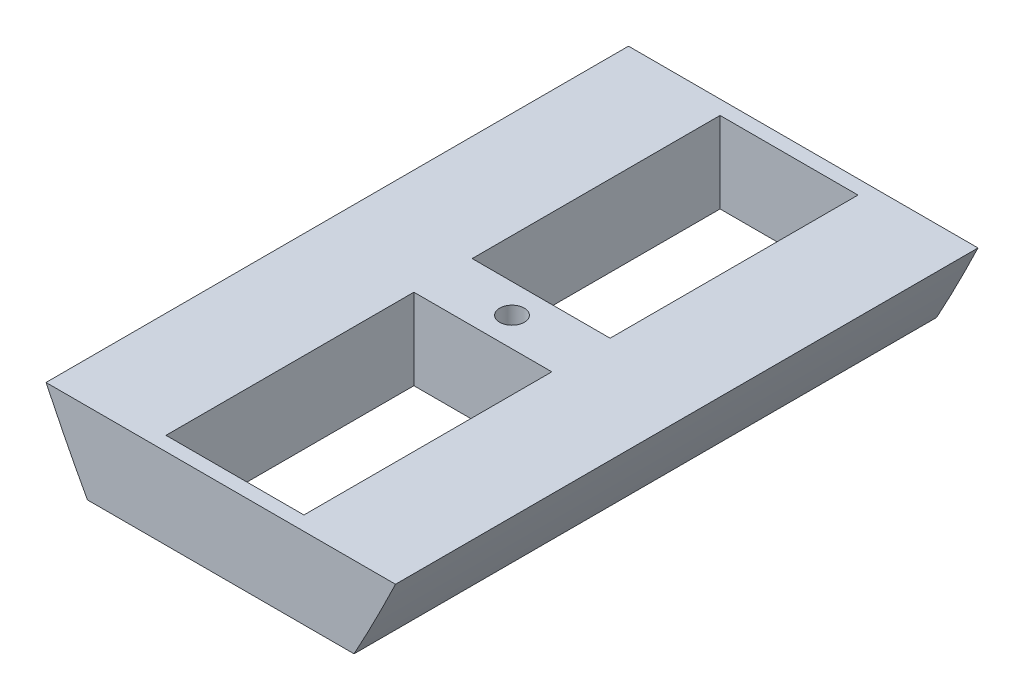
ISO-10303-21;
HEADER;
FILE_DESCRIPTION(('STEP AP214'),'2;1');
FILE_NAME('part.step','',(''),(''),'','','');
FILE_SCHEMA(('AUTOMOTIVE_DESIGN { 1 0 10303 214 1 1 1 1 }'));
ENDSEC;
DATA;
#1=APPLICATION_CONTEXT('core data for automotive mechanical design processes');
#2=APPLICATION_PROTOCOL_DEFINITION('international standard','automotive_design',2000,#1);
#3=PRODUCT_CONTEXT('',#1,'mechanical');
#4=PRODUCT('Part','Part','',(#3));
#5=PRODUCT_RELATED_PRODUCT_CATEGORY('part','',(#4));
#6=PRODUCT_DEFINITION_FORMATION('','',#4);
#7=PRODUCT_DEFINITION_CONTEXT('part definition',#1,'design');
#8=PRODUCT_DEFINITION('design','',#6,#7);
#9=PRODUCT_DEFINITION_SHAPE('','',#8);
#10=(LENGTH_UNIT() NAMED_UNIT(*) SI_UNIT(.MILLI.,.METRE.));
#11=(NAMED_UNIT(*) PLANE_ANGLE_UNIT() SI_UNIT($,.RADIAN.));
#12=(NAMED_UNIT(*) SI_UNIT($,.STERADIAN.) SOLID_ANGLE_UNIT());
#13=UNCERTAINTY_MEASURE_WITH_UNIT(LENGTH_MEASURE(1.E-05),#10,'distance_accuracy_value','');
#14=(GEOMETRIC_REPRESENTATION_CONTEXT(3) GLOBAL_UNCERTAINTY_ASSIGNED_CONTEXT((#13)) GLOBAL_UNIT_ASSIGNED_CONTEXT((#10,
#11,#12)) REPRESENTATION_CONTEXT('',''));
#15=CARTESIAN_POINT('',(0.,0.,0.));
#16=DIRECTION('',(0.,0.,1.));
#17=DIRECTION('',(1.,0.,0.));
#18=AXIS2_PLACEMENT_3D('',#15,#16,#17);
#19=CARTESIAN_POINT('',(0.,-41.72,0.));
#20=DIRECTION('',(0.,1.,0.));
#21=DIRECTION('',(0.,0.,1.));
#22=AXIS2_PLACEMENT_3D('',#19,#20,#21);
#23=PLANE('',#22);
#24=DIRECTION('',(1.,0.,0.));
#25=VECTOR('',#24,1.);
#26=CARTESIAN_POINT('',(-52.7426338619544,-41.72,-150.));
#27=LINE('',#26,#25);
#28=CARTESIAN_POINT('',(-68.6535478647462,-41.7200000000003,-150.));
#29=VERTEX_POINT('',#28);
#30=CARTESIAN_POINT('',(68.6535448442305,-41.7199999999999,-150.));
#31=VERTEX_POINT('',#30);
#32=EDGE_CURVE('E131',#29,#31,#27,.T.);
#33=ORIENTED_EDGE('',*,*,#32,.T.);
#34=DIRECTION('',(0.,0.,1.));
#35=VECTOR('',#34,1.);
#36=CARTESIAN_POINT('',(68.6535448442304,-41.72,-150.));
#37=LINE('',#36,#35);
#38=CARTESIAN_POINT('',(68.6535448442305,-41.7199999999999,150.));
#39=VERTEX_POINT('',#38);
#40=EDGE_CURVE('E138',#31,#39,#37,.T.);
#41=ORIENTED_EDGE('',*,*,#40,.T.);
#42=DIRECTION('',(1.,0.,0.));
#43=VECTOR('',#42,1.);
#44=CARTESIAN_POINT('',(-52.7426338619544,-41.72,150.));
#45=LINE('',#44,#43);
#46=CARTESIAN_POINT('',(-68.6535478647462,-41.7200000000003,150.));
#47=VERTEX_POINT('',#46);
#48=EDGE_CURVE('E133',#47,#39,#45,.T.);
#49=ORIENTED_EDGE('',*,*,#48,.F.);
#50=DIRECTION('',(0.,0.,1.));
#51=VECTOR('',#50,1.);
#52=CARTESIAN_POINT('',(-68.6535478647463,-41.72,-150.));
#53=LINE('',#52,#51);
#54=EDGE_CURVE('E127',#47,#29,#53,.F.);
#55=ORIENTED_EDGE('',*,*,#54,.T.);
#56=EDGE_LOOP('',(#33,#41,#49,#55));
#57=FACE_BOUND('',#56,.T.);
#58=CARTESIAN_POINT('',(0.,-41.72,0.));
#59=DIRECTION('',(0.,1.,0.));
#60=DIRECTION('',(0.,0.,1.));
#61=AXIS2_PLACEMENT_3D('',#58,#59,#60);
#62=CIRCLE('',#61,6.35);
#63=CARTESIAN_POINT('',(0.,-41.72,6.35));
#64=VERTEX_POINT('',#63);
#65=EDGE_CURVE('E160',#64,#64,#62,.F.);
#66=ORIENTED_EDGE('',*,*,#65,.F.);
#67=EDGE_LOOP('',(#66));
#68=FACE_BOUND('',#67,.T.);
#69=DIRECTION('',(1.,0.,0.));
#70=VECTOR('',#69,1.);
#71=CARTESIAN_POINT('',(35.5199999999569,-41.72,15.));
#72=LINE('',#71,#70);
#73=CARTESIAN_POINT('',(-35.5200000000194,-41.72,15.));
#74=VERTEX_POINT('',#73);
#75=CARTESIAN_POINT('',(35.5199999999806,-41.72,15.));
#76=VERTEX_POINT('',#75);
#77=EDGE_CURVE('E222',#74,#76,#72,.T.);
#78=ORIENTED_EDGE('',*,*,#77,.F.);
#79=DIRECTION('',(0.,0.,-1.));
#80=VECTOR('',#79,1.);
#81=CARTESIAN_POINT('',(-35.5200000000195,-41.72,142.682));
#82=LINE('',#81,#80);
#83=CARTESIAN_POINT('',(-35.5200000000195,-41.72,142.682));
#84=VERTEX_POINT('',#83);
#85=EDGE_CURVE('E221',#84,#74,#82,.T.);
#86=ORIENTED_EDGE('',*,*,#85,.F.);
#87=DIRECTION('',(-1.,0.,0.));
#88=VECTOR('',#87,1.);
#89=CARTESIAN_POINT('',(35.5199999999569,-41.72,142.682));
#90=LINE('',#89,#88);
#91=CARTESIAN_POINT('',(35.5199999999805,-41.72,142.682));
#92=VERTEX_POINT('',#91);
#93=EDGE_CURVE('E219',#92,#84,#90,.T.);
#94=ORIENTED_EDGE('',*,*,#93,.F.);
#95=DIRECTION('',(0.,0.,1.));
#96=VECTOR('',#95,1.);
#97=CARTESIAN_POINT('',(35.5199999999805,-41.72,142.682));
#98=LINE('',#97,#96);
#99=EDGE_CURVE('E217',#76,#92,#98,.T.);
#100=ORIENTED_EDGE('',*,*,#99,.F.);
#101=EDGE_LOOP('',(#78,#86,#94,#100));
#102=FACE_BOUND('',#101,.T.);
#103=DIRECTION('',(-1.,0.,0.));
#104=VECTOR('',#103,1.);
#105=CARTESIAN_POINT('',(35.5199999999569,-41.72,-15.));
#106=LINE('',#105,#104);
#107=CARTESIAN_POINT('',(35.5199999999806,-41.72,-15.));
#108=VERTEX_POINT('',#107);
#109=CARTESIAN_POINT('',(-35.5200000000194,-41.72,-15.));
#110=VERTEX_POINT('',#109);
#111=EDGE_CURVE('E214',#108,#110,#106,.T.);
#112=ORIENTED_EDGE('',*,*,#111,.F.);
#113=DIRECTION('',(0.,0.,1.));
#114=VECTOR('',#113,1.);
#115=CARTESIAN_POINT('',(35.5199999999805,-41.72,-142.682));
#116=LINE('',#115,#114);
#117=CARTESIAN_POINT('',(35.5199999999805,-41.72,-142.682));
#118=VERTEX_POINT('',#117);
#119=EDGE_CURVE('E212',#118,#108,#116,.T.);
#120=ORIENTED_EDGE('',*,*,#119,.F.);
#121=DIRECTION('',(1.,0.,0.));
#122=VECTOR('',#121,1.);
#123=CARTESIAN_POINT('',(35.5199999999569,-41.72,-142.682));
#124=LINE('',#123,#122);
#125=CARTESIAN_POINT('',(-35.5200000000195,-41.72,-142.682));
#126=VERTEX_POINT('',#125);
#127=EDGE_CURVE('E210',#126,#118,#124,.T.);
#128=ORIENTED_EDGE('',*,*,#127,.F.);
#129=DIRECTION('',(0.,0.,-1.));
#130=VECTOR('',#129,1.);
#131=CARTESIAN_POINT('',(-35.5200000000195,-41.72,-142.682));
#132=LINE('',#131,#130);
#133=EDGE_CURVE('E208',#110,#126,#132,.T.);
#134=ORIENTED_EDGE('',*,*,#133,.F.);
#135=EDGE_LOOP('',(#112,#120,#128,#134));
#136=FACE_BOUND('',#135,.T.);
#137=ADVANCED_FACE('F33',(#57,#68,#102,#136),#23,.F.);
#138=CARTESIAN_POINT('',(35.5199999999569,-92.5200000000166,-142.682));
#139=DIRECTION('',(0.,0.,-1.));
#140=DIRECTION('',(-1.,0.,0.));
#141=AXIS2_PLACEMENT_3D('',#138,#139,#140);
#142=PLANE('',#141);
#143=DIRECTION('',(4.6610767750375E-13,1.,0.));
#144=VECTOR('',#143,1.);
#145=CARTESIAN_POINT('',(-35.5200000000431,-92.5199999999835,-142.682));
#146=LINE('',#145,#144);
#147=CARTESIAN_POINT('',(-35.52,1.65561447049332E-11,-142.682));
#148=VERTEX_POINT('',#147);
#149=EDGE_CURVE('E197',#126,#148,#146,.T.);
#150=ORIENTED_EDGE('',*,*,#149,.F.);
#151=ORIENTED_EDGE('',*,*,#127,.T.);
#152=DIRECTION('',(4.6610767750375E-13,1.,0.));
#153=VECTOR('',#152,1.);
#154=CARTESIAN_POINT('',(35.5199999999569,-92.5200000000166,-142.682));
#155=LINE('',#154,#153);
#156=CARTESIAN_POINT('',(35.52,-1.65561447049332E-11,-142.682));
#157=VERTEX_POINT('',#156);
#158=EDGE_CURVE('E195',#118,#157,#155,.T.);
#159=ORIENTED_EDGE('',*,*,#158,.T.);
#160=DIRECTION('',(-1.,4.6610767750375E-13,0.));
#161=VECTOR('',#160,1.);
#162=CARTESIAN_POINT('',(35.52,-1.65561447049332E-11,-142.682));
#163=LINE('',#162,#161);
#164=EDGE_CURVE('E192',#157,#148,#163,.T.);
#165=ORIENTED_EDGE('',*,*,#164,.T.);
#166=EDGE_LOOP('',(#150,#151,#159,#165));
#167=FACE_BOUND('',#166,.T.);
#168=ADVANCED_FACE('F170',(#167),#142,.F.);
#169=CARTESIAN_POINT('',(35.5199999999569,-92.5200000000166,142.682));
#170=DIRECTION('',(0.,0.,1.));
#171=DIRECTION('',(1.,0.,0.));
#172=AXIS2_PLACEMENT_3D('',#169,#170,#171);
#173=PLANE('',#172);
#174=DIRECTION('',(4.6610767750375E-13,1.,0.));
#175=VECTOR('',#174,1.);
#176=CARTESIAN_POINT('',(35.5199999999569,-92.5200000000166,142.682));
#177=LINE('',#176,#175);
#178=CARTESIAN_POINT('',(35.52,-1.65561447049332E-11,142.682));
#179=VERTEX_POINT('',#178);
#180=EDGE_CURVE('E187',#92,#179,#177,.T.);
#181=ORIENTED_EDGE('',*,*,#180,.F.);
#182=ORIENTED_EDGE('',*,*,#93,.T.);
#183=DIRECTION('',(4.6610767750375E-13,1.,0.));
#184=VECTOR('',#183,1.);
#185=CARTESIAN_POINT('',(-35.5200000000431,-92.5199999999835,142.682));
#186=LINE('',#185,#184);
#187=CARTESIAN_POINT('',(-35.52,1.65561447049332E-11,142.682));
#188=VERTEX_POINT('',#187);
#189=EDGE_CURVE('E60',#84,#188,#186,.T.);
#190=ORIENTED_EDGE('',*,*,#189,.T.);
#191=DIRECTION('',(1.,-4.6610767750375E-13,0.));
#192=VECTOR('',#191,1.);
#193=CARTESIAN_POINT('',(35.52,-1.65561447049332E-11,142.682));
#194=LINE('',#193,#192);
#195=EDGE_CURVE('E184',#188,#179,#194,.T.);
#196=ORIENTED_EDGE('',*,*,#195,.T.);
#197=EDGE_LOOP('',(#181,#182,#190,#196));
#198=FACE_BOUND('',#197,.T.);
#199=ADVANCED_FACE('F281',(#198),#173,.F.);
#200=CARTESIAN_POINT('',(-90.,0.,-150.));
#201=DIRECTION('',(0.,1.,0.));
#202=DIRECTION('',(0.,0.,1.));
#203=AXIS2_PLACEMENT_3D('',#200,#201,#202);
#204=PLANE('',#203);
#205=CARTESIAN_POINT('',(0.,0.,0.));
#206=DIRECTION('',(0.,1.,0.));
#207=DIRECTION('',(0.,0.,1.));
#208=AXIS2_PLACEMENT_3D('',#205,#206,#207);
#209=CIRCLE('',#208,6.35);
#210=CARTESIAN_POINT('',(0.,0.,6.35));
#211=VERTEX_POINT('',#210);
#212=EDGE_CURVE('E11',#211,#211,#209,.T.);
#213=ORIENTED_EDGE('',*,*,#212,.F.);
#214=EDGE_LOOP('',(#213));
#215=FACE_BOUND('',#214,.T.);
#216=DIRECTION('',(0.,0.,-1.));
#217=VECTOR('',#216,1.);
#218=CARTESIAN_POINT('',(35.52,-1.65561447049332E-11,142.682));
#219=LINE('',#218,#217);
#220=CARTESIAN_POINT('',(35.52,0.,15.));
#221=VERTEX_POINT('',#220);
#222=EDGE_CURVE('E44',#179,#221,#219,.T.);
#223=ORIENTED_EDGE('',*,*,#222,.F.);
#224=ORIENTED_EDGE('',*,*,#195,.F.);
#225=DIRECTION('',(0.,0.,1.));
#226=VECTOR('',#225,1.);
#227=CARTESIAN_POINT('',(-35.52,1.65561447049332E-11,142.682));
#228=LINE('',#227,#226);
#229=CARTESIAN_POINT('',(-35.52,1.65561447049332E-11,15.));
#230=VERTEX_POINT('',#229);
#231=EDGE_CURVE('E249',#230,#188,#228,.T.);
#232=ORIENTED_EDGE('',*,*,#231,.F.);
#233=DIRECTION('',(-1.,4.6610767750375E-13,0.));
#234=VECTOR('',#233,1.);
#235=CARTESIAN_POINT('',(35.52,-1.65561447049332E-11,15.));
#236=LINE('',#235,#234);
#237=EDGE_CURVE('E251',#221,#230,#236,.T.);
#238=ORIENTED_EDGE('',*,*,#237,.F.);
#239=EDGE_LOOP('',(#223,#224,#232,#238));
#240=FACE_BOUND('',#239,.T.);
#241=DIRECTION('',(0.,0.,1.));
#242=VECTOR('',#241,1.);
#243=CARTESIAN_POINT('',(-35.52,1.65561447049332E-11,-142.682));
#244=LINE('',#243,#242);
#245=CARTESIAN_POINT('',(-35.5200000000431,0.,-15.));
#246=VERTEX_POINT('',#245);
#247=EDGE_CURVE('E189',#148,#246,#244,.T.);
#248=ORIENTED_EDGE('',*,*,#247,.F.);
#249=ORIENTED_EDGE('',*,*,#164,.F.);
#250=DIRECTION('',(0.,0.,-1.));
#251=VECTOR('',#250,1.);
#252=CARTESIAN_POINT('',(35.52,-1.65561447049332E-11,-142.682));
#253=LINE('',#252,#251);
#254=CARTESIAN_POINT('',(35.52,-1.65561447049332E-11,-15.));
#255=VERTEX_POINT('',#254);
#256=EDGE_CURVE('E240',#255,#157,#253,.T.);
#257=ORIENTED_EDGE('',*,*,#256,.F.);
#258=DIRECTION('',(1.,-4.6610767750375E-13,0.));
#259=VECTOR('',#258,1.);
#260=CARTESIAN_POINT('',(35.52,-1.65561447049332E-11,-15.));
#261=LINE('',#260,#259);
#262=EDGE_CURVE('E243',#246,#255,#261,.T.);
#263=ORIENTED_EDGE('',*,*,#262,.F.);
#264=EDGE_LOOP('',(#248,#249,#257,#263));
#265=FACE_BOUND('',#264,.T.);
#266=DIRECTION('',(-1.,0.,0.));
#267=VECTOR('',#266,1.);
#268=CARTESIAN_POINT('',(-90.,0.,150.));
#269=LINE('',#268,#267);
#270=CARTESIAN_POINT('',(89.9999999999832,-1.11765701056352E-11,150.));
#271=VERTEX_POINT('',#270);
#272=CARTESIAN_POINT('',(-90.,0.,150.));
#273=VERTEX_POINT('',#272);
#274=EDGE_CURVE('E150',#271,#273,#269,.T.);
#275=ORIENTED_EDGE('',*,*,#274,.F.);
#276=DIRECTION('',(0.,0.,1.));
#277=VECTOR('',#276,1.);
#278=CARTESIAN_POINT('',(89.9999999999832,-1.11765701056352E-11,-150.));
#279=LINE('',#278,#277);
#280=CARTESIAN_POINT('',(89.9999999999832,-1.11765701056352E-11,-150.));
#281=VERTEX_POINT('',#280);
#282=EDGE_CURVE('E230',#281,#271,#279,.T.);
#283=ORIENTED_EDGE('',*,*,#282,.F.);
#284=DIRECTION('',(-1.,0.,0.));
#285=VECTOR('',#284,1.);
#286=CARTESIAN_POINT('',(-90.,0.,-150.));
#287=LINE('',#286,#285);
#288=CARTESIAN_POINT('',(-90.,0.,-150.));
#289=VERTEX_POINT('',#288);
#290=EDGE_CURVE('E154',#281,#289,#287,.T.);
#291=ORIENTED_EDGE('',*,*,#290,.T.);
#292=DIRECTION('',(0.,0.,1.));
#293=VECTOR('',#292,1.);
#294=CARTESIAN_POINT('',(-90.,0.,-150.));
#295=LINE('',#294,#293);
#296=EDGE_CURVE('E149',#289,#273,#295,.T.);
#297=ORIENTED_EDGE('',*,*,#296,.T.);
#298=EDGE_LOOP('',(#275,#283,#291,#297));
#299=FACE_BOUND('',#298,.T.);
#300=ADVANCED_FACE('F261',(#215,#240,#265,#299),#204,.T.);
#301=CARTESIAN_POINT('',(0.,-124.999999999991,0.));
#302=DIRECTION('',(0.,1.,0.));
#303=DIRECTION('',(0.,0.,1.));
#304=AXIS2_PLACEMENT_3D('',#301,#302,#303);
#305=CYLINDRICAL_SURFACE('',#304,6.35);
#306=ORIENTED_EDGE('',*,*,#65,.T.);
#307=EDGE_LOOP('',(#306));
#308=FACE_BOUND('',#307,.T.);
#309=ORIENTED_EDGE('',*,*,#212,.T.);
#310=EDGE_LOOP('',(#309));
#311=FACE_BOUND('',#310,.T.);
#312=ADVANCED_FACE('F294',(#308,#311),#305,.F.);
#313=CARTESIAN_POINT('',(35.5199999999569,-92.5200000000166,142.682));
#314=DIRECTION('',(1.,-4.6610767750375E-13,0.));
#315=DIRECTION('',(4.6610767750375E-13,1.,0.));
#316=AXIS2_PLACEMENT_3D('',#313,#314,#315);
#317=PLANE('',#316);
#318=DIRECTION('',(4.6610767750375E-13,1.,0.));
#319=VECTOR('',#318,1.);
#320=CARTESIAN_POINT('',(35.5199999999569,-92.5200000000166,15.));
#321=LINE('',#320,#319);
#322=EDGE_CURVE('E179',#76,#221,#321,.T.);
#323=ORIENTED_EDGE('',*,*,#322,.F.);
#324=ORIENTED_EDGE('',*,*,#99,.T.);
#325=ORIENTED_EDGE('',*,*,#180,.T.);
#326=ORIENTED_EDGE('',*,*,#222,.T.);
#327=EDGE_LOOP('',(#323,#324,#325,#326));
#328=FACE_BOUND('',#327,.T.);
#329=ADVANCED_FACE('F256',(#328),#317,.F.);
#330=CARTESIAN_POINT('',(-35.5200000000431,-92.5199999999835,142.682));
#331=DIRECTION('',(-1.,4.6610767750375E-13,0.));
#332=DIRECTION('',(-4.6610767750375E-13,-1.,0.));
#333=AXIS2_PLACEMENT_3D('',#330,#331,#332);
#334=PLANE('',#333);
#335=ORIENTED_EDGE('',*,*,#189,.F.);
#336=ORIENTED_EDGE('',*,*,#85,.T.);
#337=DIRECTION('',(4.6610767750375E-13,1.,0.));
#338=VECTOR('',#337,1.);
#339=CARTESIAN_POINT('',(-35.5200000000431,-92.5199999999835,15.));
#340=LINE('',#339,#338);
#341=EDGE_CURVE('E52',#74,#230,#340,.T.);
#342=ORIENTED_EDGE('',*,*,#341,.T.);
#343=ORIENTED_EDGE('',*,*,#231,.T.);
#344=EDGE_LOOP('',(#335,#336,#342,#343));
#345=FACE_BOUND('',#344,.T.);
#346=ADVANCED_FACE('F266',(#345),#334,.F.);
#347=CARTESIAN_POINT('',(35.5199999999569,-92.5200000000166,15.));
#348=DIRECTION('',(0.,0.,-1.));
#349=DIRECTION('',(-1.,0.,0.));
#350=AXIS2_PLACEMENT_3D('',#347,#348,#349);
#351=PLANE('',#350);
#352=ORIENTED_EDGE('',*,*,#341,.F.);
#353=ORIENTED_EDGE('',*,*,#77,.T.);
#354=ORIENTED_EDGE('',*,*,#322,.T.);
#355=ORIENTED_EDGE('',*,*,#237,.T.);
#356=EDGE_LOOP('',(#352,#353,#354,#355));
#357=FACE_BOUND('',#356,.T.);
#358=ADVANCED_FACE('F263',(#357),#351,.F.);
#359=CARTESIAN_POINT('',(-35.5200000000431,-92.5199999999835,-142.682));
#360=DIRECTION('',(-1.,4.6610767750375E-13,0.));
#361=DIRECTION('',(-4.6610767750375E-13,-1.,0.));
#362=AXIS2_PLACEMENT_3D('',#359,#360,#361);
#363=PLANE('',#362);
#364=DIRECTION('',(4.6610767750375E-13,1.,0.));
#365=VECTOR('',#364,1.);
#366=CARTESIAN_POINT('',(-35.5200000000431,-92.5199999999835,-15.));
#367=LINE('',#366,#365);
#368=EDGE_CURVE('E190',#110,#246,#367,.T.);
#369=ORIENTED_EDGE('',*,*,#368,.F.);
#370=ORIENTED_EDGE('',*,*,#133,.T.);
#371=ORIENTED_EDGE('',*,*,#149,.T.);
#372=ORIENTED_EDGE('',*,*,#247,.T.);
#373=EDGE_LOOP('',(#369,#370,#371,#372));
#374=FACE_BOUND('',#373,.T.);
#375=ADVANCED_FACE('F265',(#374),#363,.F.);
#376=CARTESIAN_POINT('',(35.5199999999569,-92.5200000000166,-142.682));
#377=DIRECTION('',(1.,-4.6610767750375E-13,0.));
#378=DIRECTION('',(4.6610767750375E-13,1.,0.));
#379=AXIS2_PLACEMENT_3D('',#376,#377,#378);
#380=PLANE('',#379);
#381=ORIENTED_EDGE('',*,*,#158,.F.);
#382=ORIENTED_EDGE('',*,*,#119,.T.);
#383=DIRECTION('',(4.6610767750375E-13,1.,0.));
#384=VECTOR('',#383,1.);
#385=CARTESIAN_POINT('',(35.5199999999569,-92.5200000000166,-15.));
#386=LINE('',#385,#384);
#387=EDGE_CURVE('E193',#108,#255,#386,.T.);
#388=ORIENTED_EDGE('',*,*,#387,.T.);
#389=ORIENTED_EDGE('',*,*,#256,.T.);
#390=EDGE_LOOP('',(#381,#382,#388,#389));
#391=FACE_BOUND('',#390,.T.);
#392=ADVANCED_FACE('F272',(#391),#380,.F.);
#393=CARTESIAN_POINT('',(35.5199999999569,-92.5200000000166,-15.));
#394=DIRECTION('',(0.,0.,1.));
#395=DIRECTION('',(1.,0.,0.));
#396=AXIS2_PLACEMENT_3D('',#393,#394,#395);
#397=PLANE('',#396);
#398=ORIENTED_EDGE('',*,*,#387,.F.);
#399=ORIENTED_EDGE('',*,*,#111,.T.);
#400=ORIENTED_EDGE('',*,*,#368,.T.);
#401=ORIENTED_EDGE('',*,*,#262,.T.);
#402=EDGE_LOOP('',(#398,#399,#400,#401));
#403=FACE_BOUND('',#402,.T.);
#404=ADVANCED_FACE('F173',(#403),#397,.F.);
#405=CARTESIAN_POINT('',(1.99214129898486E-11,-124.999999999991,-150.));
#406=CARTESIAN_POINT('',(0.04052417634533,-124.999999999991,-150.));
#407=CARTESIAN_POINT('',(0.132680738283907,-124.99443985728,-150.));
#408=CARTESIAN_POINT('',(0.341916523726012,-124.973583458145,-150.));
#409=CARTESIAN_POINT('',(0.719215848390711,-124.91674855859,-150.));
#410=CARTESIAN_POINT('',(1.28935930871222,-124.795671244914,-150.));
#411=CARTESIAN_POINT('',(2.1112509865546,-124.564993975685,-150.));
#412=CARTESIAN_POINT('',(3.18818849420226,-124.185399035379,-150.));
#413=CARTESIAN_POINT('',(4.55335692038526,-123.602067095226,-150.));
#414=CARTESIAN_POINT('',(6.24002426541317,-122.749483932227,-150.));
#415=CARTESIAN_POINT('',(8.30348536666619,-121.537471111829,-150.));
#416=CARTESIAN_POINT('',(10.7243382527977,-119.906336413897,-150.));
#417=CARTESIAN_POINT('',(13.7092244855474,-117.633146505461,-150.));
#418=CARTESIAN_POINT('',(17.1252704538273,-114.699994739705,-150.));
#419=CARTESIAN_POINT('',(20.824901988488,-111.164506708708,-150.));
#420=CARTESIAN_POINT('',(25.6391672478892,-106.109725012407,-150.));
#421=CARTESIAN_POINT('',(30.2221890811447,-100.781084361829,-150.));
#422=CARTESIAN_POINT('',(34.5982081132701,-95.2835059363638,-150.));
#423=CARTESIAN_POINT('',(38.7796921951659,-89.6846419299041,-150.));
#424=CARTESIAN_POINT('',(42.0337209653883,-85.1391537234017,-150.));
#425=CARTESIAN_POINT('',(45.9985706416375,-79.3851400766188,-150.));
#426=CARTESIAN_POINT('',(50.6076658418213,-72.3798694722059,-150.));
#427=CARTESIAN_POINT('',(55.055097052488,-65.270591125802,-150.));
#428=CARTESIAN_POINT('',(59.3647173178988,-58.0777276161543,-150.));
#429=CARTESIAN_POINT('',(62.8735066015738,-52.0349417086849,-150.));
#430=CARTESIAN_POINT('',(65.634088968463,-47.1744500309476,-150.));
#431=CARTESIAN_POINT('',(68.3515562987782,-42.2889644712454,-150.));
#432=CARTESIAN_POINT('',(71.0277192556287,-37.3820919874342,-150.));
#433=CARTESIAN_POINT('',(73.6663047604021,-32.452622561229,-150.));
#434=CARTESIAN_POINT('',(76.2670434158788,-27.5070381241099,-150.));
#435=CARTESIAN_POINT('',(78.5150328576176,-23.1588395824158,-150.));
#436=CARTESIAN_POINT('',(80.4175372929979,-19.4295342924188,-150.));
#437=CARTESIAN_POINT('',(81.9960888607339,-16.3021347604907,-150.));
#438=CARTESIAN_POINT('',(83.240093312196,-13.8196133785879,-150.));
#439=CARTESIAN_POINT('',(84.4992613941908,-11.2861580881193,-150.));
#440=CARTESIAN_POINT('',(85.7104943097678,-8.83370724481799,-150.));
#441=CARTESIAN_POINT('',(86.9855106959538,-6.22997447285261,-150.));
#442=CARTESIAN_POINT('',(88.1249163210447,-3.89080690589355,-150.));
#443=CARTESIAN_POINT('',(89.1658132896917,-1.73506722129004,-150.));
#444=CARTESIAN_POINT('',(89.7250298990975,-0.57285437685675,-150.));
#445=CARTESIAN_POINT('',(89.9999999999832,-1.11765701056352E-11,-150.));
#446=B_SPLINE_CURVE_WITH_KNOTS('',4,(#405,#406,#407,#408,#409,#410,#411,#412,#413,#414,#415,
#416,#417,#418,#419,#420,#421,#422,#423,#424,#425,#426,#427,#428,#429,#430,#431,#432,#433,#434,
#435,#436,#437,#438,#439,#440,#441,#442,#443,#444,#445),.UNSPECIFIED.,.F.,.F.,(5,1,1,1,1,1,1,1,
1,1,1,1,1,1,1,1,1,1,1,1,1,1,1,1,1,1,1,1,1,1,1,1,1,1,1,1,1,5),(0.,0.00103393706164033,
0.00206787412328066,0.00483210811938311,0.00888853236437909,0.0145219388316572,
0.0218771335459272,0.0312978599904631,0.0433163034992764,0.0583393941879713,0.0773686452817039,
0.0989852332180189,0.130325067263289,0.162749733599858,0.196051036585961,0.260900538334195,
0.293325323762978,0.325750109191762,0.358174889345657,0.390599669499551,0.455449159051982,
0.520298707054147,0.552723498859379,0.585148290664611,0.617573035285626,0.649997779906641,
0.682422553117547,0.714847326328452,0.747272094857862,0.779696863387272,0.795909247738012,
0.812121632088752,0.828334016439492,0.844546400790232,0.860758800534671,0.876971200279109,
0.893183600023547,0.909395999767985),.UNSPECIFIED.);
#447=DIRECTION('',(0.,0.,1.));
#448=VECTOR('',#447,1.);
#449=SURFACE_OF_LINEAR_EXTRUSION('',#446,#448);
#450=ORIENTED_EDGE('',*,*,#40,.F.);
#451=EDGE_CURVE('E146',#31,#281,#446,.T.);
#452=ORIENTED_EDGE('',*,*,#451,.T.);
#453=ORIENTED_EDGE('',*,*,#282,.T.);
#454=CARTESIAN_POINT('',(1.99214129898486E-11,-124.999999999991,150.));
#455=CARTESIAN_POINT('',(0.04052417634533,-124.999999999991,150.));
#456=CARTESIAN_POINT('',(0.132680738283907,-124.99443985728,150.));
#457=CARTESIAN_POINT('',(0.341916523726012,-124.973583458145,150.));
#458=CARTESIAN_POINT('',(0.719215848390711,-124.91674855859,150.));
#459=CARTESIAN_POINT('',(1.28935930871222,-124.795671244914,150.));
#460=CARTESIAN_POINT('',(2.1112509865546,-124.564993975685,150.));
#461=CARTESIAN_POINT('',(3.18818849420226,-124.185399035379,150.));
#462=CARTESIAN_POINT('',(4.55335692038526,-123.602067095226,150.));
#463=CARTESIAN_POINT('',(6.24002426541317,-122.749483932227,150.));
#464=CARTESIAN_POINT('',(8.30348536666619,-121.537471111829,150.));
#465=CARTESIAN_POINT('',(10.7243382527977,-119.906336413897,150.));
#466=CARTESIAN_POINT('',(13.7092244855474,-117.633146505461,150.));
#467=CARTESIAN_POINT('',(17.1252704538273,-114.699994739705,150.));
#468=CARTESIAN_POINT('',(20.824901988488,-111.164506708708,150.));
#469=CARTESIAN_POINT('',(25.6391672478892,-106.109725012407,150.));
#470=CARTESIAN_POINT('',(30.2221890811447,-100.781084361829,150.));
#471=CARTESIAN_POINT('',(34.5982081132701,-95.2835059363638,150.));
#472=CARTESIAN_POINT('',(38.7796921951659,-89.6846419299041,150.));
#473=CARTESIAN_POINT('',(42.0337209653883,-85.1391537234017,150.));
#474=CARTESIAN_POINT('',(45.9985706416375,-79.3851400766188,150.));
#475=CARTESIAN_POINT('',(50.6076658418213,-72.3798694722059,150.));
#476=CARTESIAN_POINT('',(55.055097052488,-65.270591125802,150.));
#477=CARTESIAN_POINT('',(59.3647173178988,-58.0777276161543,150.));
#478=CARTESIAN_POINT('',(62.8735066015738,-52.0349417086849,150.));
#479=CARTESIAN_POINT('',(65.634088968463,-47.1744500309476,150.));
#480=CARTESIAN_POINT('',(68.3515562987782,-42.2889644712454,150.));
#481=CARTESIAN_POINT('',(71.0277192556287,-37.3820919874342,150.));
#482=CARTESIAN_POINT('',(73.6663047604021,-32.452622561229,150.));
#483=CARTESIAN_POINT('',(76.2670434158788,-27.5070381241099,150.));
#484=CARTESIAN_POINT('',(78.5150328576176,-23.1588395824158,150.));
#485=CARTESIAN_POINT('',(80.4175372929979,-19.4295342924188,150.));
#486=CARTESIAN_POINT('',(81.9960888607339,-16.3021347604907,150.));
#487=CARTESIAN_POINT('',(83.240093312196,-13.8196133785879,150.));
#488=CARTESIAN_POINT('',(84.4992613941908,-11.2861580881193,150.));
#489=CARTESIAN_POINT('',(85.7104943097678,-8.83370724481799,150.));
#490=CARTESIAN_POINT('',(86.9855106959538,-6.22997447285261,150.));
#491=CARTESIAN_POINT('',(88.1249163210447,-3.89080690589355,150.));
#492=CARTESIAN_POINT('',(89.1658132896917,-1.73506722129004,150.));
#493=CARTESIAN_POINT('',(89.7250298990975,-0.57285437685675,150.));
#494=CARTESIAN_POINT('',(89.9999999999832,-1.11765701056352E-11,150.));
#495=B_SPLINE_CURVE_WITH_KNOTS('',4,(#454,#455,#456,#457,#458,#459,#460,#461,#462,#463,#464,
#465,#466,#467,#468,#469,#470,#471,#472,#473,#474,#475,#476,#477,#478,#479,#480,#481,#482,#483,
#484,#485,#486,#487,#488,#489,#490,#491,#492,#493,#494),.UNSPECIFIED.,.F.,.F.,(5,1,1,1,1,1,1,1,
1,1,1,1,1,1,1,1,1,1,1,1,1,1,1,1,1,1,1,1,1,1,1,1,1,1,1,1,1,5),(0.,0.00103393706164033,
0.00206787412328066,0.00483210811938311,0.00888853236437909,0.0145219388316572,
0.0218771335459272,0.0312978599904631,0.0433163034992764,0.0583393941879713,0.0773686452817039,
0.0989852332180189,0.130325067263289,0.162749733599858,0.196051036585961,0.260900538334195,
0.293325323762978,0.325750109191762,0.358174889345657,0.390599669499551,0.455449159051982,
0.520298707054147,0.552723498859379,0.585148290664611,0.617573035285626,0.649997779906641,
0.682422553117547,0.714847326328452,0.747272094857862,0.779696863387272,0.795909247738012,
0.812121632088752,0.828334016439492,0.844546400790232,0.860758800534671,0.876971200279109,
0.893183600023547,0.909395999767985),.UNSPECIFIED.);
#496=EDGE_CURVE('E37',#39,#271,#495,.T.);
#497=ORIENTED_EDGE('',*,*,#496,.F.);
#498=EDGE_LOOP('',(#450,#452,#453,#497));
#499=FACE_BOUND('',#498,.T.);
#500=ADVANCED_FACE('F169',(#499),#449,.T.);
#501=CARTESIAN_POINT('',(-90.000000000001,2.02389109575604E-12,-150.));
#502=CARTESIAN_POINT('',(-89.7287799215119,-0.565041830183454,-150.));
#503=CARTESIAN_POINT('',(-89.1769696999906,-1.7119011396164,-150.));
#504=CARTESIAN_POINT('',(-88.1522968285625,-3.83418853962012,-150.));
#505=CARTESIAN_POINT('',(-87.0256216323926,-6.14778150957435,-150.));
#506=CARTESIAN_POINT('',(-85.7702408599494,-8.71205451363004,-150.));
#507=CARTESIAN_POINT('',(-84.5750109306655,-11.1331330972931,-150.));
#508=CARTESIAN_POINT('',(-83.3334861961047,-13.6323373136231,-150.));
#509=CARTESIAN_POINT('',(-82.1079807270131,-16.0793853852928,-150.));
#510=CARTESIAN_POINT('',(-80.8613078480234,-18.5512681634737,-150.));
#511=CARTESIAN_POINT('',(-79.6147241148221,-21.0031983730774,-150.));
#512=CARTESIAN_POINT('',(-78.0419469470306,-24.073051937383,-150.));
#513=CARTESIAN_POINT('',(-76.1411202296189,-27.7433014503863,-150.));
#514=CARTESIAN_POINT('',(-73.8976202164458,-32.0158335495403,-150.));
#515=CARTESIAN_POINT('',(-71.2993743897047,-36.8781590882088,-150.));
#516=CARTESIAN_POINT('',(-68.6634579703094,-41.7214329736065,-150.));
#517=CARTESIAN_POINT('',(-65.3196001268725,-47.7478310919678,-150.));
#518=CARTESIAN_POINT('',(-61.9057750936895,-53.7354515988975,-150.));
#519=CARTESIAN_POINT('',(-58.4153924458366,-59.6785805494722,-150.));
#520=CARTESIAN_POINT('',(-54.1245222469686,-66.7491790365763,-150.));
#521=CARTESIAN_POINT('',(-50.4569081107591,-72.584773085158,-150.));
#522=CARTESIAN_POINT('',(-46.6861989824506,-78.3546086656338,-150.));
#523=CARTESIAN_POINT('',(-42.0196546172396,-85.183243954868,-150.));
#524=CARTESIAN_POINT('',(-37.1971625918209,-91.9035094496485,-150.));
#525=CARTESIAN_POINT('',(-31.9659496817484,-98.6943750875519,-150.));
#526=CARTESIAN_POINT('',(-26.4240119309792,-105.235278479561,-150.));
#527=CARTESIAN_POINT('',(-21.5050773033514,-110.483804705851,-150.));
#528=CARTESIAN_POINT('',(-17.6257924713411,-114.241326427069,-150.));
#529=CARTESIAN_POINT('',(-14.1803245350885,-117.248508249794,-150.));
#530=CARTESIAN_POINT('',(-11.1234549797758,-119.618653213116,-150.));
#531=CARTESIAN_POINT('',(-8.63557314303448,-121.326761696326,-150.));
#532=CARTESIAN_POINT('',(-6.50865865296434,-122.601737804343,-150.));
#533=CARTESIAN_POINT('',(-4.76818473699802,-123.501182230943,-150.));
#534=CARTESIAN_POINT('',(-3.3618837973863,-124.11729408906,-150.));
#535=CARTESIAN_POINT('',(-2.23928333382458,-124.524207656603,-150.));
#536=CARTESIAN_POINT('',(-1.38198372297948,-124.772747972149,-150.));
#537=CARTESIAN_POINT('',(-0.75617299970219,-124.911034050922,-150.));
#538=CARTESIAN_POINT('',(-0.347330621147917,-124.973877643986,-150.));
#539=CARTESIAN_POINT('',(-0.123395647498381,-124.995337069226,-150.));
#540=CARTESIAN_POINT('',(-0.0205041113270957,-124.999999999991,-150.));
#541=CARTESIAN_POINT('',(1.99373958062784E-11,-124.999999999991,-150.));
#542=B_SPLINE_CURVE_WITH_KNOTS('',4,(#501,#502,#503,#504,#505,#506,#507,#508,#509,#510,#511,
#512,#513,#514,#515,#516,#517,#518,#519,#520,#521,#522,#523,#524,#525,#526,#527,#528,#529,#530,
#531,#532,#533,#534,#535,#536,#537,#538,#539,#540,#541),.UNSPECIFIED.,.F.,.F.,(5,1,1,1,1,1,1,1,
1,1,1,1,1,1,1,1,1,1,1,1,1,1,1,1,1,1,1,1,1,1,1,1,1,1,1,1,1,5),(0.0906040002037184,
0.106595296404402,0.122586592605086,0.138577888805769,0.154569185006453,0.170560469837402,
0.186551754668351,0.2025430394993,0.218534324330249,0.234525597989239,0.250516871648229,
0.282499418966208,0.314481991055738,0.346464563145268,0.378447154569264,0.410429745993261,
0.474394816871329,0.50637741432234,0.538360011773351,0.602325099359595,0.634307686149558,
0.666290272939521,0.730255400632888,0.794220554496453,0.833134058899479,0.865116624781684,
0.897099301206955,0.919478735971019,0.939186071609823,0.954818475650913,0.967077107134405,
0.976978528047083,0.984613115136046,0.990416571643528,0.994763933757022,0.997672430907831,
0.999476856470563,1.),.UNSPECIFIED.);
#543=DIRECTION('',(0.,0.,1.));
#544=VECTOR('',#543,1.);
#545=SURFACE_OF_LINEAR_EXTRUSION('',#542,#544);
#546=ORIENTED_EDGE('',*,*,#54,.F.);
#547=CARTESIAN_POINT('',(-90.000000000001,2.02389109575604E-12,150.));
#548=CARTESIAN_POINT('',(-89.7287799215119,-0.565041830183454,150.));
#549=CARTESIAN_POINT('',(-89.1769696999906,-1.7119011396164,150.));
#550=CARTESIAN_POINT('',(-88.1522968285625,-3.83418853962012,150.));
#551=CARTESIAN_POINT('',(-87.0256216323926,-6.14778150957435,150.));
#552=CARTESIAN_POINT('',(-85.7702408599494,-8.71205451363004,150.));
#553=CARTESIAN_POINT('',(-84.5750109306655,-11.1331330972931,150.));
#554=CARTESIAN_POINT('',(-83.3334861961047,-13.6323373136231,150.));
#555=CARTESIAN_POINT('',(-82.1079807270131,-16.0793853852928,150.));
#556=CARTESIAN_POINT('',(-80.8613078480234,-18.5512681634737,150.));
#557=CARTESIAN_POINT('',(-79.6147241148221,-21.0031983730774,150.));
#558=CARTESIAN_POINT('',(-78.0419469470306,-24.073051937383,150.));
#559=CARTESIAN_POINT('',(-76.1411202296189,-27.7433014503863,150.));
#560=CARTESIAN_POINT('',(-73.8976202164458,-32.0158335495403,150.));
#561=CARTESIAN_POINT('',(-71.2993743897047,-36.8781590882088,150.));
#562=CARTESIAN_POINT('',(-68.6634579703094,-41.7214329736065,150.));
#563=CARTESIAN_POINT('',(-65.3196001268725,-47.7478310919678,150.));
#564=CARTESIAN_POINT('',(-61.9057750936895,-53.7354515988975,150.));
#565=CARTESIAN_POINT('',(-58.4153924458366,-59.6785805494722,150.));
#566=CARTESIAN_POINT('',(-54.1245222469686,-66.7491790365763,150.));
#567=CARTESIAN_POINT('',(-50.4569081107591,-72.584773085158,150.));
#568=CARTESIAN_POINT('',(-46.6861989824506,-78.3546086656338,150.));
#569=CARTESIAN_POINT('',(-42.0196546172396,-85.183243954868,150.));
#570=CARTESIAN_POINT('',(-37.1971625918209,-91.9035094496485,150.));
#571=CARTESIAN_POINT('',(-31.9659496817484,-98.6943750875519,150.));
#572=CARTESIAN_POINT('',(-26.4240119309792,-105.235278479561,150.));
#573=CARTESIAN_POINT('',(-21.5050773033514,-110.483804705851,150.));
#574=CARTESIAN_POINT('',(-17.6257924713411,-114.241326427069,150.));
#575=CARTESIAN_POINT('',(-14.1803245350885,-117.248508249794,150.));
#576=CARTESIAN_POINT('',(-11.1234549797758,-119.618653213116,150.));
#577=CARTESIAN_POINT('',(-8.63557314303448,-121.326761696326,150.));
#578=CARTESIAN_POINT('',(-6.50865865296434,-122.601737804343,150.));
#579=CARTESIAN_POINT('',(-4.76818473699802,-123.501182230943,150.));
#580=CARTESIAN_POINT('',(-3.3618837973863,-124.11729408906,150.));
#581=CARTESIAN_POINT('',(-2.23928333382458,-124.524207656603,150.));
#582=CARTESIAN_POINT('',(-1.38198372297948,-124.772747972149,150.));
#583=CARTESIAN_POINT('',(-0.75617299970219,-124.911034050922,150.));
#584=CARTESIAN_POINT('',(-0.347330621147917,-124.973877643986,150.));
#585=CARTESIAN_POINT('',(-0.123395647498381,-124.995337069226,150.));
#586=CARTESIAN_POINT('',(-0.0205041113270957,-124.999999999991,150.));
#587=CARTESIAN_POINT('',(1.99373958062784E-11,-124.999999999991,150.));
#588=B_SPLINE_CURVE_WITH_KNOTS('',4,(#547,#548,#549,#550,#551,#552,#553,#554,#555,#556,#557,
#558,#559,#560,#561,#562,#563,#564,#565,#566,#567,#568,#569,#570,#571,#572,#573,#574,#575,#576,
#577,#578,#579,#580,#581,#582,#583,#584,#585,#586,#587),.UNSPECIFIED.,.F.,.F.,(5,1,1,1,1,1,1,1,
1,1,1,1,1,1,1,1,1,1,1,1,1,1,1,1,1,1,1,1,1,1,1,1,1,1,1,1,1,5),(0.0906040002037184,
0.106595296404402,0.122586592605086,0.138577888805769,0.154569185006453,0.170560469837402,
0.186551754668351,0.2025430394993,0.218534324330249,0.234525597989239,0.250516871648229,
0.282499418966208,0.314481991055738,0.346464563145268,0.378447154569264,0.410429745993261,
0.474394816871329,0.50637741432234,0.538360011773351,0.602325099359595,0.634307686149558,
0.666290272939521,0.730255400632888,0.794220554496453,0.833134058899479,0.865116624781684,
0.897099301206955,0.919478735971019,0.939186071609823,0.954818475650913,0.967077107134405,
0.976978528047083,0.984613115136046,0.990416571643528,0.994763933757022,0.997672430907831,
0.999476856470563,1.),.UNSPECIFIED.);
#589=EDGE_CURVE('E199',#273,#47,#588,.T.);
#590=ORIENTED_EDGE('',*,*,#589,.F.);
#591=ORIENTED_EDGE('',*,*,#296,.F.);
#592=EDGE_CURVE('E144',#289,#29,#542,.T.);
#593=ORIENTED_EDGE('',*,*,#592,.T.);
#594=EDGE_LOOP('',(#546,#590,#591,#593));
#595=FACE_BOUND('',#594,.T.);
#596=ADVANCED_FACE('F148',(#595),#545,.T.);
#597=CARTESIAN_POINT('',(-52.7426338619544,-68.9224547357826,150.));
#598=DIRECTION('',(0.,0.,-1.));
#599=DIRECTION('',(-1.,0.,0.));
#600=AXIS2_PLACEMENT_3D('',#597,#598,#599);
#601=PLANE('',#600);
#602=ORIENTED_EDGE('',*,*,#589,.T.);
#603=ORIENTED_EDGE('',*,*,#48,.T.);
#604=ORIENTED_EDGE('',*,*,#496,.T.);
#605=ORIENTED_EDGE('',*,*,#274,.T.);
#606=EDGE_LOOP('',(#602,#603,#604,#605));
#607=FACE_BOUND('',#606,.T.);
#608=ADVANCED_FACE('F35',(#607),#601,.F.);
#609=CARTESIAN_POINT('',(-52.7426338619544,-68.9224547357826,-150.));
#610=DIRECTION('',(0.,0.,-1.));
#611=DIRECTION('',(-1.,0.,0.));
#612=AXIS2_PLACEMENT_3D('',#609,#610,#611);
#613=PLANE('',#612);
#614=ORIENTED_EDGE('',*,*,#32,.F.);
#615=ORIENTED_EDGE('',*,*,#592,.F.);
#616=ORIENTED_EDGE('',*,*,#290,.F.);
#617=ORIENTED_EDGE('',*,*,#451,.F.);
#618=EDGE_LOOP('',(#614,#615,#616,#617));
#619=FACE_BOUND('',#618,.T.);
#620=ADVANCED_FACE('F142',(#619),#613,.T.);
#621=CLOSED_SHELL('',(#137,#168,#199,#300,#312,#329,#346,#358,#375,#392,#404,#500,#596,#608,#620));
#622=MANIFOLD_SOLID_BREP('B2',#621);
#623=ADVANCED_BREP_SHAPE_REPRESENTATION('',(#18,#622),#14);
#624=SHAPE_DEFINITION_REPRESENTATION(#9,#623);
ENDSEC;
END-ISO-10303-21;
